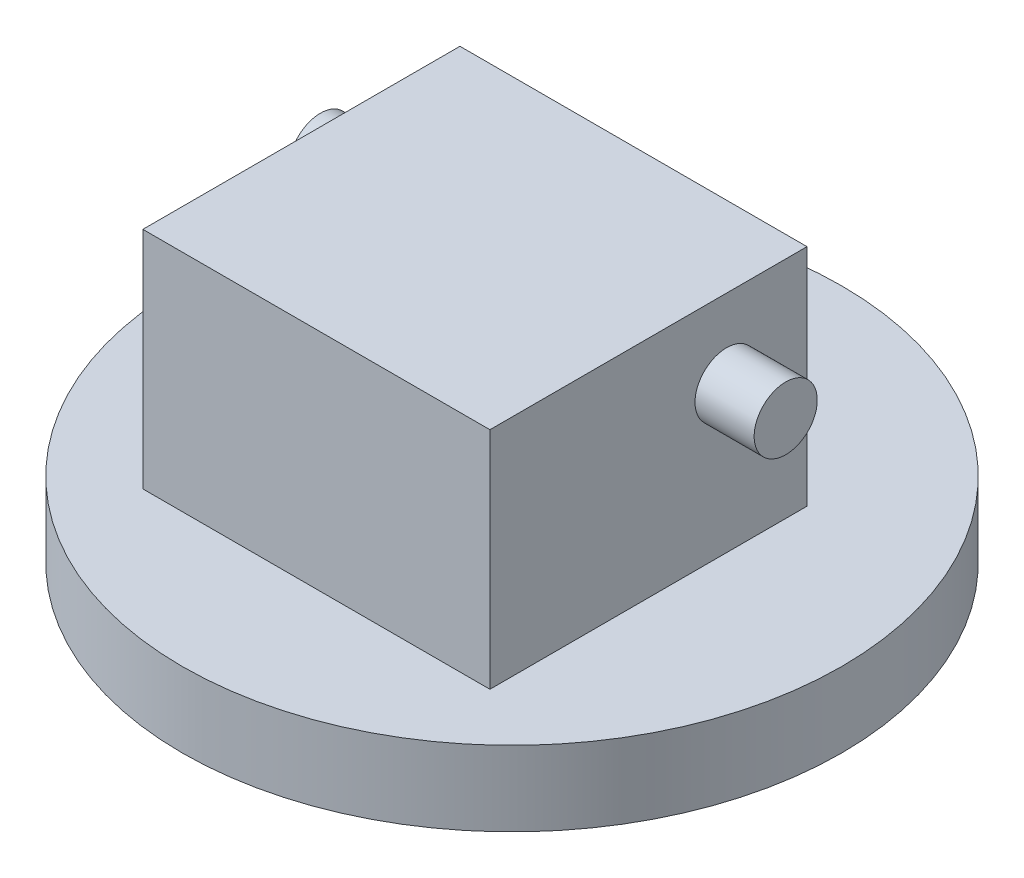
ISO-10303-21;
HEADER;
FILE_DESCRIPTION(('STEP AP214'),'2;1');
FILE_NAME('part.step','',(''),(''),'','','');
FILE_SCHEMA(('AUTOMOTIVE_DESIGN { 1 0 10303 214 1 1 1 1 }'));
ENDSEC;
DATA;
#1=APPLICATION_CONTEXT('core data for automotive mechanical design processes');
#2=APPLICATION_PROTOCOL_DEFINITION('international standard','automotive_design',2000,#1);
#3=PRODUCT_CONTEXT('',#1,'mechanical');
#4=PRODUCT('Part','Part','',(#3));
#5=PRODUCT_RELATED_PRODUCT_CATEGORY('part','',(#4));
#6=PRODUCT_DEFINITION_FORMATION('','',#4);
#7=PRODUCT_DEFINITION_CONTEXT('part definition',#1,'design');
#8=PRODUCT_DEFINITION('design','',#6,#7);
#9=PRODUCT_DEFINITION_SHAPE('','',#8);
#10=(LENGTH_UNIT() NAMED_UNIT(*) SI_UNIT(.MILLI.,.METRE.));
#11=(NAMED_UNIT(*) PLANE_ANGLE_UNIT() SI_UNIT($,.RADIAN.));
#12=(NAMED_UNIT(*) SI_UNIT($,.STERADIAN.) SOLID_ANGLE_UNIT());
#13=UNCERTAINTY_MEASURE_WITH_UNIT(LENGTH_MEASURE(1.E-05),#10,'distance_accuracy_value','');
#14=(GEOMETRIC_REPRESENTATION_CONTEXT(3) GLOBAL_UNCERTAINTY_ASSIGNED_CONTEXT((#13)) GLOBAL_UNIT_ASSIGNED_CONTEXT((#10,
#11,#12)) REPRESENTATION_CONTEXT('',''));
#15=CARTESIAN_POINT('',(0.,0.,0.));
#16=DIRECTION('',(0.,0.,1.));
#17=DIRECTION('',(1.,0.,0.));
#18=AXIS2_PLACEMENT_3D('',#15,#16,#17);
#19=CARTESIAN_POINT('',(0.,9.5,0.));
#20=DIRECTION('',(0.,1.,0.));
#21=DIRECTION('',(0.,0.,1.));
#22=AXIS2_PLACEMENT_3D('',#19,#20,#21);
#23=PLANE('',#22);
#24=CARTESIAN_POINT('',(0.,9.5,0.));
#25=DIRECTION('',(0.,1.,0.));
#26=DIRECTION('',(0.,0.,1.));
#27=AXIS2_PLACEMENT_3D('',#24,#25,#26);
#28=CIRCLE('',#27,41.8);
#29=CARTESIAN_POINT('',(0.,9.5,41.8));
#30=VERTEX_POINT('',#29);
#31=EDGE_CURVE('E11',#30,#30,#28,.T.);
#32=ORIENTED_EDGE('',*,*,#31,.T.);
#33=EDGE_LOOP('',(#32));
#34=FACE_BOUND('',#33,.T.);
#35=DIRECTION('',(1.,0.,0.));
#36=VECTOR('',#35,1.);
#37=CARTESIAN_POINT('',(0.,9.5,-15.4));
#38=LINE('',#37,#36);
#39=CARTESIAN_POINT('',(-22.,9.5,-15.4));
#40=VERTEX_POINT('',#39);
#41=CARTESIAN_POINT('',(22.,9.5,-15.4));
#42=VERTEX_POINT('',#41);
#43=EDGE_CURVE('E92',#40,#42,#38,.T.);
#44=ORIENTED_EDGE('',*,*,#43,.T.);
#45=DIRECTION('',(0.,0.,1.));
#46=VECTOR('',#45,1.);
#47=CARTESIAN_POINT('',(22.,9.5,0.));
#48=LINE('',#47,#46);
#49=CARTESIAN_POINT('',(22.,9.5,24.8));
#50=VERTEX_POINT('',#49);
#51=EDGE_CURVE('E57',#42,#50,#48,.T.);
#52=ORIENTED_EDGE('',*,*,#51,.T.);
#53=DIRECTION('',(-1.,0.,0.));
#54=VECTOR('',#53,1.);
#55=CARTESIAN_POINT('',(0.,9.5,24.8));
#56=LINE('',#55,#54);
#57=CARTESIAN_POINT('',(-22.,9.5,24.8));
#58=VERTEX_POINT('',#57);
#59=EDGE_CURVE('E108',#50,#58,#56,.T.);
#60=ORIENTED_EDGE('',*,*,#59,.T.);
#61=DIRECTION('',(0.,0.,1.));
#62=VECTOR('',#61,1.);
#63=CARTESIAN_POINT('',(-22.,9.5,0.));
#64=LINE('',#63,#62);
#65=EDGE_CURVE('E116',#40,#58,#64,.T.);
#66=ORIENTED_EDGE('',*,*,#65,.F.);
#67=EDGE_LOOP('',(#44,#52,#60,#66));
#68=FACE_BOUND('',#67,.T.);
#69=ADVANCED_FACE('F42',(#34,#68),#23,.T.);
#70=CARTESIAN_POINT('',(0.,9.5,0.));
#71=DIRECTION('',(0.,-1.,0.));
#72=DIRECTION('',(0.,0.,-1.));
#73=AXIS2_PLACEMENT_3D('',#70,#71,#72);
#74=CYLINDRICAL_SURFACE('',#73,41.8);
#75=ORIENTED_EDGE('',*,*,#31,.F.);
#76=EDGE_LOOP('',(#75));
#77=FACE_BOUND('',#76,.T.);
#78=CARTESIAN_POINT('',(0.,0.,0.));
#79=DIRECTION('',(0.,1.,0.));
#80=DIRECTION('',(0.,0.,1.));
#81=AXIS2_PLACEMENT_3D('',#78,#79,#80);
#82=CIRCLE('',#81,41.8);
#83=CARTESIAN_POINT('',(0.,0.,41.8));
#84=VERTEX_POINT('',#83);
#85=EDGE_CURVE('E46',#84,#84,#82,.T.);
#86=ORIENTED_EDGE('',*,*,#85,.T.);
#87=EDGE_LOOP('',(#86));
#88=FACE_BOUND('',#87,.T.);
#89=ADVANCED_FACE('F44',(#77,#88),#74,.T.);
#90=CARTESIAN_POINT('',(0.,0.,0.));
#91=DIRECTION('',(0.,1.,0.));
#92=DIRECTION('',(0.,0.,1.));
#93=AXIS2_PLACEMENT_3D('',#90,#91,#92);
#94=PLANE('',#93);
#95=ORIENTED_EDGE('',*,*,#85,.F.);
#96=EDGE_LOOP('',(#95));
#97=FACE_BOUND('',#96,.T.);
#98=ADVANCED_FACE('F126',(#97),#94,.F.);
#99=CARTESIAN_POINT('',(22.,38.,0.));
#100=DIRECTION('',(1.,0.,0.));
#101=DIRECTION('',(0.,0.,-1.));
#102=AXIS2_PLACEMENT_3D('',#99,#100,#101);
#103=PLANE('',#102);
#104=CARTESIAN_POINT('',(22.,28.,-5.20000000000001));
#105=DIRECTION('',(1.,0.,0.));
#106=DIRECTION('',(0.,0.,-1.));
#107=AXIS2_PLACEMENT_3D('',#104,#105,#106);
#108=CIRCLE('',#107,4.);
#109=CARTESIAN_POINT('',(22.,28.,-9.20000000000001));
#110=VERTEX_POINT('',#109);
#111=EDGE_CURVE('E173',#110,#110,#108,.T.);
#112=ORIENTED_EDGE('',*,*,#111,.F.);
#113=EDGE_LOOP('',(#112));
#114=FACE_BOUND('',#113,.T.);
#115=ORIENTED_EDGE('',*,*,#51,.F.);
#116=DIRECTION('',(0.,-1.,0.));
#117=VECTOR('',#116,1.);
#118=CARTESIAN_POINT('',(22.,38.,-15.4));
#119=LINE('',#118,#117);
#120=CARTESIAN_POINT('',(22.,38.,-15.4));
#121=VERTEX_POINT('',#120);
#122=EDGE_CURVE('E80',#121,#42,#119,.T.);
#123=ORIENTED_EDGE('',*,*,#122,.F.);
#124=DIRECTION('',(0.,0.,1.));
#125=VECTOR('',#124,1.);
#126=CARTESIAN_POINT('',(22.,38.,0.));
#127=LINE('',#126,#125);
#128=CARTESIAN_POINT('',(22.,38.,24.8));
#129=VERTEX_POINT('',#128);
#130=EDGE_CURVE('E106',#121,#129,#127,.T.);
#131=ORIENTED_EDGE('',*,*,#130,.T.);
#132=DIRECTION('',(0.,-1.,0.));
#133=VECTOR('',#132,1.);
#134=CARTESIAN_POINT('',(22.,38.,24.8));
#135=LINE('',#134,#133);
#136=EDGE_CURVE('E65',#129,#50,#135,.T.);
#137=ORIENTED_EDGE('',*,*,#136,.T.);
#138=EDGE_LOOP('',(#115,#123,#131,#137));
#139=FACE_BOUND('',#138,.T.);
#140=ADVANCED_FACE('F128',(#114,#139),#103,.T.);
#141=CARTESIAN_POINT('',(0.,38.,-15.4));
#142=DIRECTION('',(0.,0.,-1.));
#143=DIRECTION('',(-1.,0.,0.));
#144=AXIS2_PLACEMENT_3D('',#141,#142,#143);
#145=PLANE('',#144);
#146=ORIENTED_EDGE('',*,*,#43,.F.);
#147=DIRECTION('',(0.,-1.,0.));
#148=VECTOR('',#147,1.);
#149=CARTESIAN_POINT('',(-22.,38.,-15.4));
#150=LINE('',#149,#148);
#151=CARTESIAN_POINT('',(-22.,38.,-15.4));
#152=VERTEX_POINT('',#151);
#153=EDGE_CURVE('E86',#152,#40,#150,.T.);
#154=ORIENTED_EDGE('',*,*,#153,.F.);
#155=DIRECTION('',(1.,0.,0.));
#156=VECTOR('',#155,1.);
#157=CARTESIAN_POINT('',(0.,38.,-15.4));
#158=LINE('',#157,#156);
#159=EDGE_CURVE('E90',#152,#121,#158,.T.);
#160=ORIENTED_EDGE('',*,*,#159,.T.);
#161=ORIENTED_EDGE('',*,*,#122,.T.);
#162=EDGE_LOOP('',(#146,#154,#160,#161));
#163=FACE_BOUND('',#162,.T.);
#164=ADVANCED_FACE('F88',(#163),#145,.T.);
#165=CARTESIAN_POINT('',(-22.,38.,0.));
#166=DIRECTION('',(1.,0.,0.));
#167=DIRECTION('',(0.,0.,-1.));
#168=AXIS2_PLACEMENT_3D('',#165,#166,#167);
#169=PLANE('',#168);
#170=CARTESIAN_POINT('',(-22.,28.,-5.20000000000001));
#171=DIRECTION('',(1.,0.,0.));
#172=DIRECTION('',(0.,0.,-1.));
#173=AXIS2_PLACEMENT_3D('',#170,#171,#172);
#174=CIRCLE('',#173,4.);
#175=CARTESIAN_POINT('',(-22.,28.,-9.20000000000001));
#176=VERTEX_POINT('',#175);
#177=EDGE_CURVE('E174',#176,#176,#174,.T.);
#178=ORIENTED_EDGE('',*,*,#177,.T.);
#179=EDGE_LOOP('',(#178));
#180=FACE_BOUND('',#179,.T.);
#181=ORIENTED_EDGE('',*,*,#65,.T.);
#182=DIRECTION('',(0.,-1.,0.));
#183=VECTOR('',#182,1.);
#184=CARTESIAN_POINT('',(-22.,38.,24.8));
#185=LINE('',#184,#183);
#186=CARTESIAN_POINT('',(-22.,38.,24.8));
#187=VERTEX_POINT('',#186);
#188=EDGE_CURVE('E96',#187,#58,#185,.T.);
#189=ORIENTED_EDGE('',*,*,#188,.F.);
#190=DIRECTION('',(0.,0.,1.));
#191=VECTOR('',#190,1.);
#192=CARTESIAN_POINT('',(-22.,38.,0.));
#193=LINE('',#192,#191);
#194=EDGE_CURVE('E99',#152,#187,#193,.T.);
#195=ORIENTED_EDGE('',*,*,#194,.F.);
#196=ORIENTED_EDGE('',*,*,#153,.T.);
#197=EDGE_LOOP('',(#181,#189,#195,#196));
#198=FACE_BOUND('',#197,.T.);
#199=ADVANCED_FACE('F100',(#180,#198),#169,.F.);
#200=CARTESIAN_POINT('',(0.,38.,24.8));
#201=DIRECTION('',(0.,0.,1.));
#202=DIRECTION('',(1.,0.,0.));
#203=AXIS2_PLACEMENT_3D('',#200,#201,#202);
#204=PLANE('',#203);
#205=ORIENTED_EDGE('',*,*,#59,.F.);
#206=ORIENTED_EDGE('',*,*,#136,.F.);
#207=DIRECTION('',(-1.,0.,0.));
#208=VECTOR('',#207,1.);
#209=CARTESIAN_POINT('',(0.,38.,24.8));
#210=LINE('',#209,#208);
#211=EDGE_CURVE('E103',#129,#187,#210,.T.);
#212=ORIENTED_EDGE('',*,*,#211,.T.);
#213=ORIENTED_EDGE('',*,*,#188,.T.);
#214=EDGE_LOOP('',(#205,#206,#212,#213));
#215=FACE_BOUND('',#214,.T.);
#216=ADVANCED_FACE('F147',(#215),#204,.T.);
#217=CARTESIAN_POINT('',(0.,38.,0.));
#218=DIRECTION('',(0.,1.,0.));
#219=DIRECTION('',(0.,0.,1.));
#220=AXIS2_PLACEMENT_3D('',#217,#218,#219);
#221=PLANE('',#220);
#222=ORIENTED_EDGE('',*,*,#130,.F.);
#223=ORIENTED_EDGE('',*,*,#159,.F.);
#224=ORIENTED_EDGE('',*,*,#194,.T.);
#225=ORIENTED_EDGE('',*,*,#211,.F.);
#226=EDGE_LOOP('',(#222,#223,#224,#225));
#227=FACE_BOUND('',#226,.T.);
#228=ADVANCED_FACE('F105',(#227),#221,.T.);
#229=CARTESIAN_POINT('',(29.5,28.,-5.20000000000001));
#230=DIRECTION('',(-1.,0.,0.));
#231=DIRECTION('',(0.,0.,1.));
#232=AXIS2_PLACEMENT_3D('',#229,#230,#231);
#233=CYLINDRICAL_SURFACE('',#232,4.);
#234=CARTESIAN_POINT('',(29.5,28.,-5.20000000000001));
#235=DIRECTION('',(1.,0.,0.));
#236=DIRECTION('',(0.,0.,-1.));
#237=AXIS2_PLACEMENT_3D('',#234,#235,#236);
#238=CIRCLE('',#237,4.);
#239=CARTESIAN_POINT('',(29.5,28.,-9.20000000000001));
#240=VERTEX_POINT('',#239);
#241=EDGE_CURVE('E114',#240,#240,#238,.T.);
#242=ORIENTED_EDGE('',*,*,#241,.F.);
#243=EDGE_LOOP('',(#242));
#244=FACE_BOUND('',#243,.T.);
#245=ORIENTED_EDGE('',*,*,#111,.T.);
#246=EDGE_LOOP('',(#245));
#247=FACE_BOUND('',#246,.T.);
#248=ADVANCED_FACE('F153',(#244,#247),#233,.T.);
#249=CARTESIAN_POINT('',(29.5,28.,-5.20000000000001));
#250=DIRECTION('',(1.,0.,0.));
#251=DIRECTION('',(0.,0.,-1.));
#252=AXIS2_PLACEMENT_3D('',#249,#250,#251);
#253=PLANE('',#252);
#254=ORIENTED_EDGE('',*,*,#241,.T.);
#255=EDGE_LOOP('',(#254));
#256=FACE_BOUND('',#255,.T.);
#257=ADVANCED_FACE('F156',(#256),#253,.T.);
#258=CARTESIAN_POINT('',(-29.5,28.,-5.20000000000001));
#259=DIRECTION('',(1.,0.,0.));
#260=DIRECTION('',(0.,0.,-1.));
#261=AXIS2_PLACEMENT_3D('',#258,#259,#260);
#262=CYLINDRICAL_SURFACE('',#261,4.);
#263=CARTESIAN_POINT('',(-29.5,28.,-5.20000000000001));
#264=DIRECTION('',(1.,0.,0.));
#265=DIRECTION('',(0.,0.,-1.));
#266=AXIS2_PLACEMENT_3D('',#263,#264,#265);
#267=CIRCLE('',#266,4.);
#268=CARTESIAN_POINT('',(-29.5,28.,-9.20000000000001));
#269=VERTEX_POINT('',#268);
#270=EDGE_CURVE('E172',#269,#269,#267,.T.);
#271=ORIENTED_EDGE('',*,*,#270,.T.);
#272=EDGE_LOOP('',(#271));
#273=FACE_BOUND('',#272,.T.);
#274=ORIENTED_EDGE('',*,*,#177,.F.);
#275=EDGE_LOOP('',(#274));
#276=FACE_BOUND('',#275,.T.);
#277=ADVANCED_FACE('F160',(#273,#276),#262,.T.);
#278=CARTESIAN_POINT('',(-29.5,28.,-5.20000000000001));
#279=DIRECTION('',(-1.,0.,0.));
#280=DIRECTION('',(0.,0.,-1.));
#281=AXIS2_PLACEMENT_3D('',#278,#279,#280);
#282=PLANE('',#281);
#283=ORIENTED_EDGE('',*,*,#270,.F.);
#284=EDGE_LOOP('',(#283));
#285=FACE_BOUND('',#284,.T.);
#286=ADVANCED_FACE('F164',(#285),#282,.T.);
#287=CLOSED_SHELL('',(#69,#89,#98,#140,#164,#199,#216,#228,#248,#257,#277,#286));
#288=MANIFOLD_SOLID_BREP('B2',#287);
#289=ADVANCED_BREP_SHAPE_REPRESENTATION('',(#18,#288),#14);
#290=SHAPE_DEFINITION_REPRESENTATION(#9,#289);
ENDSEC;
END-ISO-10303-21;
